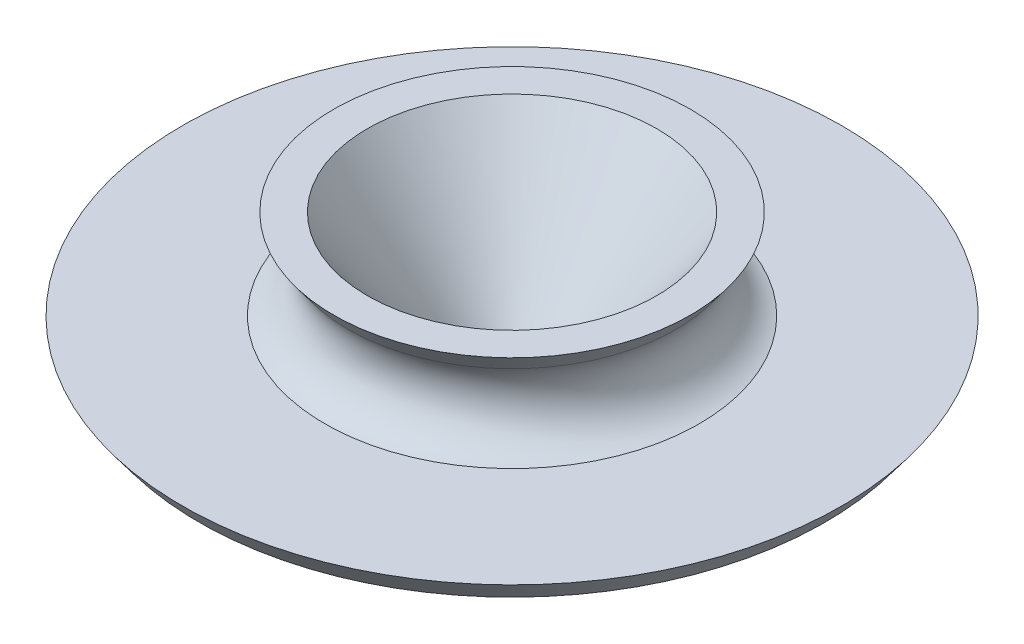
ISO-10303-21;
HEADER;
FILE_DESCRIPTION(('STEP AP214'),'2;1');
FILE_NAME('part.step','',(''),(''),'','','');
FILE_SCHEMA(('AUTOMOTIVE_DESIGN { 1 0 10303 214 1 1 1 1 }'));
ENDSEC;
DATA;
#1=APPLICATION_CONTEXT('core data for automotive mechanical design processes');
#2=APPLICATION_PROTOCOL_DEFINITION('international standard','automotive_design',2000,#1);
#3=PRODUCT_CONTEXT('',#1,'mechanical');
#4=PRODUCT('Part','Part','',(#3));
#5=PRODUCT_RELATED_PRODUCT_CATEGORY('part','',(#4));
#6=PRODUCT_DEFINITION_FORMATION('','',#4);
#7=PRODUCT_DEFINITION_CONTEXT('part definition',#1,'design');
#8=PRODUCT_DEFINITION('design','',#6,#7);
#9=PRODUCT_DEFINITION_SHAPE('','',#8);
#10=(LENGTH_UNIT() NAMED_UNIT(*) SI_UNIT(.MILLI.,.METRE.));
#11=(NAMED_UNIT(*) PLANE_ANGLE_UNIT() SI_UNIT($,.RADIAN.));
#12=(NAMED_UNIT(*) SI_UNIT($,.STERADIAN.) SOLID_ANGLE_UNIT());
#13=UNCERTAINTY_MEASURE_WITH_UNIT(LENGTH_MEASURE(1.E-05),#10,'distance_accuracy_value','');
#14=(GEOMETRIC_REPRESENTATION_CONTEXT(3) GLOBAL_UNCERTAINTY_ASSIGNED_CONTEXT((#13)) GLOBAL_UNIT_ASSIGNED_CONTEXT((#10,
#11,#12)) REPRESENTATION_CONTEXT('',''));
#15=CARTESIAN_POINT('',(0.,0.,0.));
#16=DIRECTION('',(0.,0.,1.));
#17=DIRECTION('',(1.,0.,0.));
#18=AXIS2_PLACEMENT_3D('',#15,#16,#17);
#19=CARTESIAN_POINT('',(11.7848669275956,-47.6827220835559,0.));
#20=DIRECTION('',(0.,1.,0.));
#21=DIRECTION('',(0.,0.,1.));
#22=AXIS2_PLACEMENT_3D('',#19,#20,#21);
#23=CONICAL_SURFACE('',#22,12.7,0.638237755706316);
#24=CARTESIAN_POINT('',(11.7848669275956,-9.58272208355591,0.));
#25=DIRECTION('',(0.,-1.,0.));
#26=DIRECTION('',(0.,0.,-1.));
#27=AXIS2_PLACEMENT_3D('',#24,#25,#26);
#28=CIRCLE('',#27,40.9628951679165);
#29=CARTESIAN_POINT('',(11.7848669275956,-9.58272208355591,-40.9628951679165));
#30=VERTEX_POINT('',#29);
#31=EDGE_CURVE('E80',#30,#30,#28,.T.);
#32=ORIENTED_EDGE('',*,*,#31,.F.);
#33=EDGE_LOOP('',(#32));
#34=FACE_BOUND('',#33,.T.);
#35=CARTESIAN_POINT('',(11.7848669275956,-47.6827220835559,0.));
#36=DIRECTION('',(0.,-1.,0.));
#37=DIRECTION('',(0.,0.,-1.));
#38=AXIS2_PLACEMENT_3D('',#35,#36,#37);
#39=CIRCLE('',#38,12.7);
#40=CARTESIAN_POINT('',(11.7848669275956,-47.6827220835559,-12.7));
#41=VERTEX_POINT('',#40);
#42=EDGE_CURVE('E10',#41,#41,#39,.T.);
#43=ORIENTED_EDGE('',*,*,#42,.T.);
#44=EDGE_LOOP('',(#43));
#45=FACE_BOUND('',#44,.T.);
#46=ADVANCED_FACE('F41',(#34,#45),#23,.F.);
#47=CARTESIAN_POINT('',(-0.915133072404383,-47.6827220835559,0.));
#48=DIRECTION('',(0.,1.,0.));
#49=DIRECTION('',(0.,0.,1.));
#50=AXIS2_PLACEMENT_3D('',#47,#48,#49);
#51=PLANE('',#50);
#52=ORIENTED_EDGE('',*,*,#42,.F.);
#53=EDGE_LOOP('',(#52));
#54=FACE_BOUND('',#53,.T.);
#55=CARTESIAN_POINT('',(11.7848669275956,-47.6827220835559,0.));
#56=DIRECTION('',(0.,-1.,0.));
#57=DIRECTION('',(0.,0.,-1.));
#58=AXIS2_PLACEMENT_3D('',#55,#56,#57);
#59=CIRCLE('',#58,33.7206114463025);
#60=CARTESIAN_POINT('',(11.7848669275956,-47.6827220835559,-33.7206114463025));
#61=VERTEX_POINT('',#60);
#62=EDGE_CURVE('E48',#61,#61,#59,.T.);
#63=ORIENTED_EDGE('',*,*,#62,.T.);
#64=EDGE_LOOP('',(#63));
#65=FACE_BOUND('',#64,.T.);
#66=ADVANCED_FACE('F88',(#54,#65),#51,.F.);
#67=CARTESIAN_POINT('',(11.7848669275956,-41.3327220835559,0.));
#68=DIRECTION('',(0.,1.,0.));
#69=DIRECTION('',(0.,0.,1.));
#70=AXIS2_PLACEMENT_3D('',#67,#68,#69);
#71=CONICAL_SURFACE('',#70,38.4310939742886,0.638237755706317);
#72=ORIENTED_EDGE('',*,*,#62,.F.);
#73=EDGE_LOOP('',(#72));
#74=FACE_BOUND('',#73,.T.);
#75=CARTESIAN_POINT('',(11.7848669275956,-41.3327220835559,0.));
#76=DIRECTION('',(0.,-1.,0.));
#77=DIRECTION('',(0.,0.,-1.));
#78=AXIS2_PLACEMENT_3D('',#75,#76,#77);
#79=CIRCLE('',#78,38.4310939742886);
#80=CARTESIAN_POINT('',(11.7848669275956,-41.3327220835559,-38.4310939742886));
#81=VERTEX_POINT('',#80);
#82=EDGE_CURVE('E53',#81,#81,#79,.T.);
#83=ORIENTED_EDGE('',*,*,#82,.T.);
#84=EDGE_LOOP('',(#83));
#85=FACE_BOUND('',#84,.T.);
#86=ADVANCED_FACE('F92',(#74,#85),#71,.T.);
#87=CARTESIAN_POINT('',(-26.646227046693,-41.3327220835559,0.));
#88=DIRECTION('',(0.,1.,0.));
#89=DIRECTION('',(0.,0.,1.));
#90=AXIS2_PLACEMENT_3D('',#87,#88,#89);
#91=PLANE('',#90);
#92=ORIENTED_EDGE('',*,*,#82,.F.);
#93=EDGE_LOOP('',(#92));
#94=FACE_BOUND('',#93,.T.);
#95=CARTESIAN_POINT('',(11.7848669275956,-41.3327220835559,0.));
#96=DIRECTION('',(0.,-1.,0.));
#97=DIRECTION('',(0.,0.,-1.));
#98=AXIS2_PLACEMENT_3D('',#95,#96,#97);
#99=CIRCLE('',#98,88.5680738121452);
#100=CARTESIAN_POINT('',(11.7848669275956,-41.3327220835559,-88.5680738121452));
#101=VERTEX_POINT('',#100);
#102=EDGE_CURVE('E58',#101,#101,#99,.T.);
#103=ORIENTED_EDGE('',*,*,#102,.T.);
#104=EDGE_LOOP('',(#103));
#105=FACE_BOUND('',#104,.T.);
#106=ADVANCED_FACE('F97',(#94,#105),#91,.F.);
#107=CARTESIAN_POINT('',(11.7848669275956,-34.9827220835559,0.));
#108=DIRECTION('',(0.,1.,0.));
#109=DIRECTION('',(0.,0.,1.));
#110=AXIS2_PLACEMENT_3D('',#107,#108,#109);
#111=CONICAL_SURFACE('',#110,93.2785563401313,0.638237755706317);
#112=ORIENTED_EDGE('',*,*,#102,.F.);
#113=EDGE_LOOP('',(#112));
#114=FACE_BOUND('',#113,.T.);
#115=CARTESIAN_POINT('',(11.7848669275956,-34.9827220835559,0.));
#116=DIRECTION('',(0.,-1.,0.));
#117=DIRECTION('',(0.,0.,-1.));
#118=AXIS2_PLACEMENT_3D('',#115,#116,#117);
#119=CIRCLE('',#118,93.2785563401313);
#120=CARTESIAN_POINT('',(11.7848669275956,-34.9827220835559,-93.2785563401313));
#121=VERTEX_POINT('',#120);
#122=EDGE_CURVE('E64',#121,#121,#119,.T.);
#123=ORIENTED_EDGE('',*,*,#122,.T.);
#124=EDGE_LOOP('',(#123));
#125=FACE_BOUND('',#124,.T.);
#126=ADVANCED_FACE('F103',(#114,#125),#111,.T.);
#127=CARTESIAN_POINT('',(-81.4936894125356,-34.9827220835559,0.));
#128=DIRECTION('',(0.,-1.,0.));
#129=DIRECTION('',(0.,0.,-1.));
#130=AXIS2_PLACEMENT_3D('',#127,#128,#129);
#131=PLANE('',#130);
#132=ORIENTED_EDGE('',*,*,#122,.F.);
#133=EDGE_LOOP('',(#132));
#134=FACE_BOUND('',#133,.T.);
#135=CARTESIAN_POINT('',(11.7848669275956,-34.9827220835559,0.));
#136=DIRECTION('',(0.,-1.,0.));
#137=DIRECTION('',(0.,0.,-1.));
#138=AXIS2_PLACEMENT_3D('',#135,#136,#137);
#139=CIRCLE('',#138,52.9713052236888);
#140=CARTESIAN_POINT('',(11.7848669275956,-34.9827220835559,-52.9713052236888));
#141=VERTEX_POINT('',#140);
#142=EDGE_CURVE('E68',#141,#141,#139,.T.);
#143=ORIENTED_EDGE('',*,*,#142,.T.);
#144=EDGE_LOOP('',(#143));
#145=FACE_BOUND('',#144,.T.);
#146=ADVANCED_FACE('F107',(#134,#145),#131,.F.);
#147=CARTESIAN_POINT('',(11.7848669275956,-22.784882293651,0.));
#148=DIRECTION('',(0.,-1.,0.));
#149=DIRECTION('',(0.,0.,-1.));
#150=AXIS2_PLACEMENT_3D('',#147,#148,#149);
#151=TOROIDAL_SURFACE('',#150,56.5072215773109,12.7);
#152=ORIENTED_EDGE('',*,*,#142,.F.);
#153=EDGE_LOOP('',(#152));
#154=FACE_BOUND('',#153,.T.);
#155=CARTESIAN_POINT('',(11.7848669275956,-15.2184632618608,0.));
#156=DIRECTION('',(0.,-1.,0.));
#157=DIRECTION('',(0.,0.,-1.));
#158=AXIS2_PLACEMENT_3D('',#155,#156,#157);
#159=CIRCLE('',#158,46.3072557423013);
#160=CARTESIAN_POINT('',(11.7848669275956,-15.2184632618608,-46.3072557423013));
#161=VERTEX_POINT('',#160);
#162=EDGE_CURVE('E72',#161,#161,#159,.T.);
#163=ORIENTED_EDGE('',*,*,#162,.T.);
#164=EDGE_LOOP('',(#163));
#165=FACE_BOUND('',#164,.T.);
#166=ADVANCED_FACE('F111',(#154,#165),#151,.F.);
#167=CARTESIAN_POINT('',(11.7848669275956,-9.58272208355592,0.));
#168=DIRECTION('',(0.,1.,0.));
#169=DIRECTION('',(0.,0.,1.));
#170=AXIS2_PLACEMENT_3D('',#167,#168,#169);
#171=CONICAL_SURFACE('',#170,50.4878951679165,0.638237755706317);
#172=ORIENTED_EDGE('',*,*,#162,.F.);
#173=EDGE_LOOP('',(#172));
#174=FACE_BOUND('',#173,.T.);
#175=CARTESIAN_POINT('',(11.7848669275956,-9.58272208355592,0.));
#176=DIRECTION('',(0.,-1.,0.));
#177=DIRECTION('',(0.,0.,-1.));
#178=AXIS2_PLACEMENT_3D('',#175,#176,#177);
#179=CIRCLE('',#178,50.4878951679165);
#180=CARTESIAN_POINT('',(11.7848669275956,-9.58272208355592,-50.4878951679165));
#181=VERTEX_POINT('',#180);
#182=EDGE_CURVE('E76',#181,#181,#179,.T.);
#183=ORIENTED_EDGE('',*,*,#182,.T.);
#184=EDGE_LOOP('',(#183));
#185=FACE_BOUND('',#184,.T.);
#186=ADVANCED_FACE('F115',(#174,#185),#171,.T.);
#187=CARTESIAN_POINT('',(-29.1780282403209,-9.58272208355592,0.));
#188=DIRECTION('',(0.,-1.,0.));
#189=DIRECTION('',(0.,0.,-1.));
#190=AXIS2_PLACEMENT_3D('',#187,#188,#189);
#191=PLANE('',#190);
#192=ORIENTED_EDGE('',*,*,#182,.F.);
#193=EDGE_LOOP('',(#192));
#194=FACE_BOUND('',#193,.T.);
#195=ORIENTED_EDGE('',*,*,#31,.T.);
#196=EDGE_LOOP('',(#195));
#197=FACE_BOUND('',#196,.T.);
#198=ADVANCED_FACE('F85',(#194,#197),#191,.F.);
#199=CLOSED_SHELL('',(#46,#66,#86,#106,#126,#146,#166,#186,#198));
#200=MANIFOLD_SOLID_BREP('B2',#199);
#201=ADVANCED_BREP_SHAPE_REPRESENTATION('',(#18,#200),#14);
#202=SHAPE_DEFINITION_REPRESENTATION(#9,#201);
ENDSEC;
END-ISO-10303-21;
